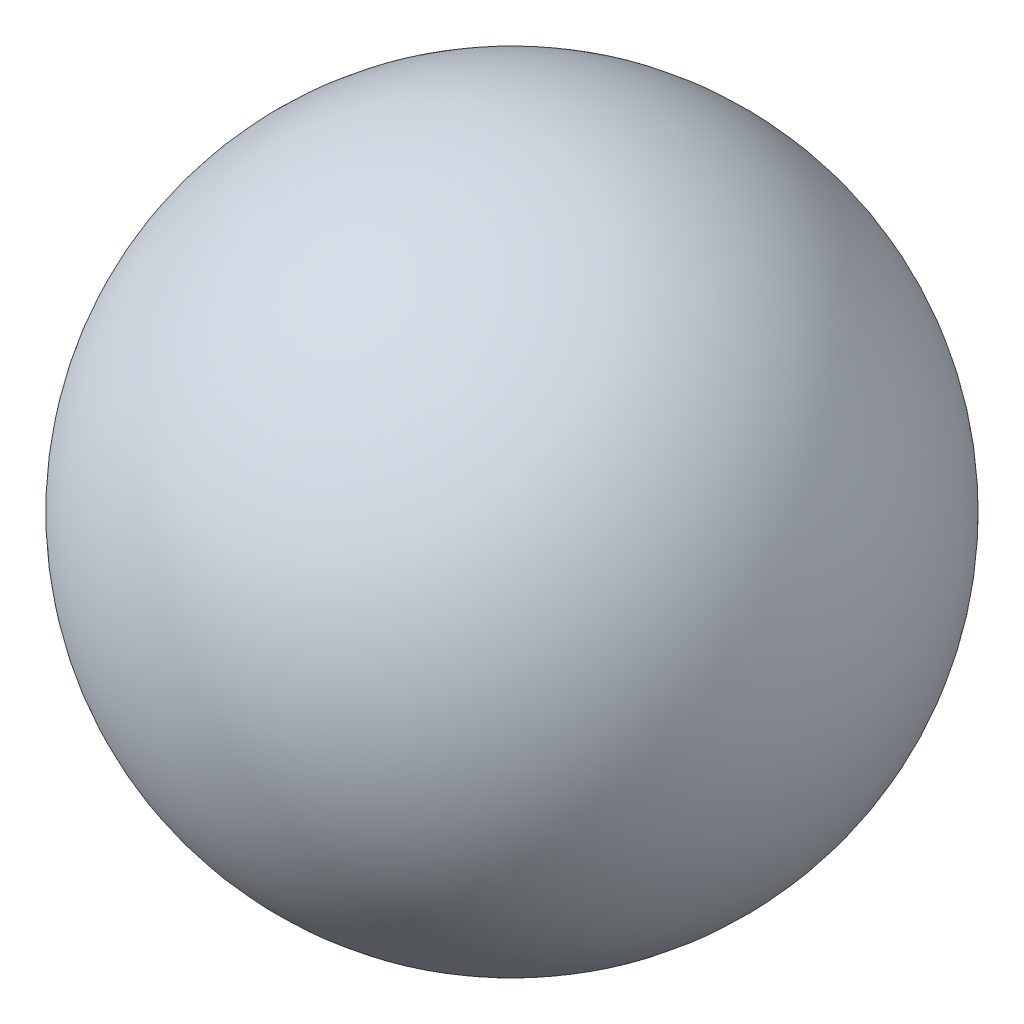
ISO-10303-21;
HEADER;
FILE_DESCRIPTION(('STEP AP214'),'2;1');
FILE_NAME('part.step','',(''),(''),'','','');
FILE_SCHEMA(('AUTOMOTIVE_DESIGN { 1 0 10303 214 1 1 1 1 }'));
ENDSEC;
DATA;
#1=APPLICATION_CONTEXT('core data for automotive mechanical design processes');
#2=APPLICATION_PROTOCOL_DEFINITION('international standard','automotive_design',2000,#1);
#3=PRODUCT_CONTEXT('',#1,'mechanical');
#4=PRODUCT('Part','Part','',(#3));
#5=PRODUCT_RELATED_PRODUCT_CATEGORY('part','',(#4));
#6=PRODUCT_DEFINITION_FORMATION('','',#4);
#7=PRODUCT_DEFINITION_CONTEXT('part definition',#1,'design');
#8=PRODUCT_DEFINITION('design','',#6,#7);
#9=PRODUCT_DEFINITION_SHAPE('','',#8);
#10=(LENGTH_UNIT() NAMED_UNIT(*) SI_UNIT(.MILLI.,.METRE.));
#11=(NAMED_UNIT(*) PLANE_ANGLE_UNIT() SI_UNIT($,.RADIAN.));
#12=(NAMED_UNIT(*) SI_UNIT($,.STERADIAN.) SOLID_ANGLE_UNIT());
#13=UNCERTAINTY_MEASURE_WITH_UNIT(LENGTH_MEASURE(1.E-05),#10,'distance_accuracy_value','');
#14=(GEOMETRIC_REPRESENTATION_CONTEXT(3) GLOBAL_UNCERTAINTY_ASSIGNED_CONTEXT((#13)) GLOBAL_UNIT_ASSIGNED_CONTEXT((#10,
#11,#12)) REPRESENTATION_CONTEXT('',''));
#15=CARTESIAN_POINT('',(0.,0.,0.));
#16=DIRECTION('',(0.,0.,1.));
#17=DIRECTION('',(1.,0.,0.));
#18=AXIS2_PLACEMENT_3D('',#15,#16,#17);
#19=CARTESIAN_POINT('',(0.,0.,0.));
#20=DIRECTION('',(0.,-1.,0.));
#21=DIRECTION('',(-1.,0.,0.));
#22=AXIS2_PLACEMENT_3D('',#19,#20,#21);
#23=SPHERICAL_SURFACE('',#22,10.);
#24=CARTESIAN_POINT('',(0.,-10.,0.));
#25=VERTEX_POINT('',#24);
#26=VERTEX_LOOP('',#25);
#27=FACE_BOUND('',#26,.T.);
#28=ADVANCED_FACE('F33',(#27),#23,.T.);
#29=CLOSED_SHELL('',(#28));
#30=MANIFOLD_SOLID_BREP('B2',#29);
#31=ADVANCED_BREP_SHAPE_REPRESENTATION('',(#18,#30),#14);
#32=SHAPE_DEFINITION_REPRESENTATION(#9,#31);
ENDSEC;
END-ISO-10303-21;
